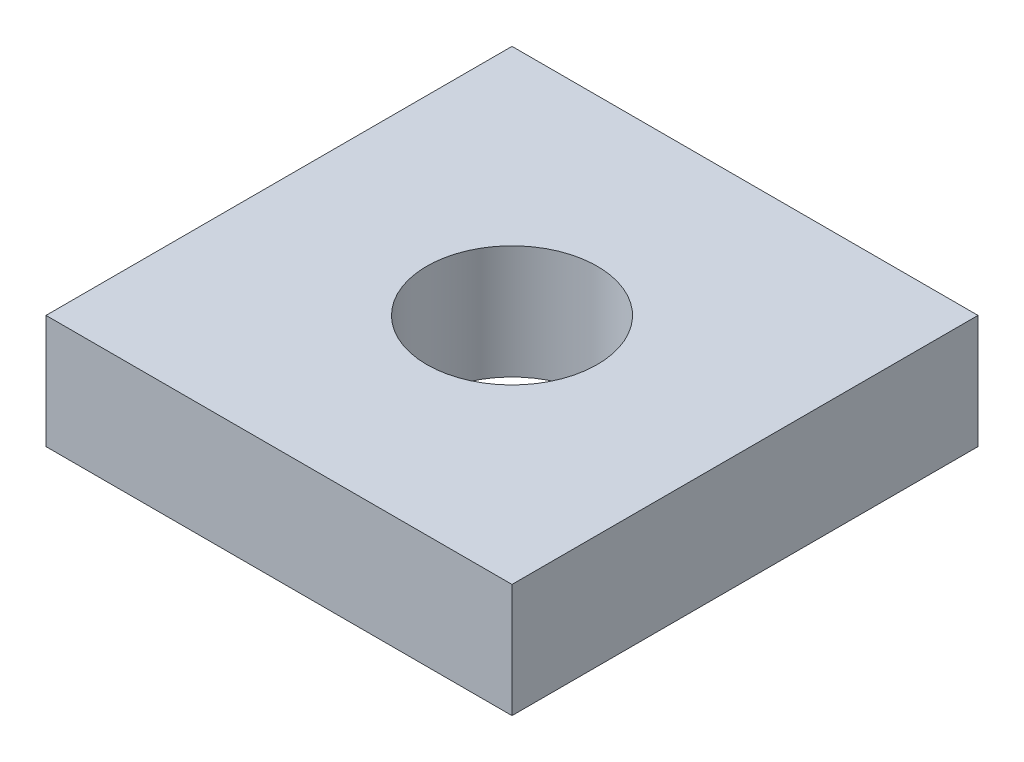
ISO-10303-21;
HEADER;
FILE_DESCRIPTION(('STEP AP214'),'2;1');
FILE_NAME('part.step','',(''),(''),'','','');
FILE_SCHEMA(('AUTOMOTIVE_DESIGN { 1 0 10303 214 1 1 1 1 }'));
ENDSEC;
DATA;
#1=APPLICATION_CONTEXT('core data for automotive mechanical design processes');
#2=APPLICATION_PROTOCOL_DEFINITION('international standard','automotive_design',2000,#1);
#3=PRODUCT_CONTEXT('',#1,'mechanical');
#4=PRODUCT('Part','Part','',(#3));
#5=PRODUCT_RELATED_PRODUCT_CATEGORY('part','',(#4));
#6=PRODUCT_DEFINITION_FORMATION('','',#4);
#7=PRODUCT_DEFINITION_CONTEXT('part definition',#1,'design');
#8=PRODUCT_DEFINITION('design','',#6,#7);
#9=PRODUCT_DEFINITION_SHAPE('','',#8);
#10=(LENGTH_UNIT() NAMED_UNIT(*) SI_UNIT(.MILLI.,.METRE.));
#11=(NAMED_UNIT(*) PLANE_ANGLE_UNIT() SI_UNIT($,.RADIAN.));
#12=(NAMED_UNIT(*) SI_UNIT($,.STERADIAN.) SOLID_ANGLE_UNIT());
#13=UNCERTAINTY_MEASURE_WITH_UNIT(LENGTH_MEASURE(1.E-05),#10,'distance_accuracy_value','');
#14=(GEOMETRIC_REPRESENTATION_CONTEXT(3) GLOBAL_UNCERTAINTY_ASSIGNED_CONTEXT((#13)) GLOBAL_UNIT_ASSIGNED_CONTEXT((#10,
#11,#12)) REPRESENTATION_CONTEXT('',''));
#15=CARTESIAN_POINT('',(0.,0.,0.));
#16=DIRECTION('',(0.,0.,1.));
#17=DIRECTION('',(1.,0.,0.));
#18=AXIS2_PLACEMENT_3D('',#15,#16,#17);
#19=CARTESIAN_POINT('',(0.,2.,0.));
#20=DIRECTION('',(0.,-1.,0.));
#21=DIRECTION('',(0.,0.,-1.));
#22=AXIS2_PLACEMENT_3D('',#19,#20,#21);
#23=PLANE('',#22);
#24=DIRECTION('',(0.,0.,1.));
#25=VECTOR('',#24,1.);
#26=CARTESIAN_POINT('',(0.,2.,0.));
#27=LINE('',#26,#25);
#28=CARTESIAN_POINT('',(0.,2.,-8.2));
#29=VERTEX_POINT('',#28);
#30=CARTESIAN_POINT('',(0.,2.,0.));
#31=VERTEX_POINT('',#30);
#32=EDGE_CURVE('E89',#29,#31,#27,.T.);
#33=ORIENTED_EDGE('',*,*,#32,.T.);
#34=DIRECTION('',(1.,0.,0.));
#35=VECTOR('',#34,1.);
#36=CARTESIAN_POINT('',(0.,2.,0.));
#37=LINE('',#36,#35);
#38=CARTESIAN_POINT('',(8.2,2.,0.));
#39=VERTEX_POINT('',#38);
#40=EDGE_CURVE('E84',#31,#39,#37,.T.);
#41=ORIENTED_EDGE('',*,*,#40,.T.);
#42=DIRECTION('',(0.,0.,-1.));
#43=VECTOR('',#42,1.);
#44=CARTESIAN_POINT('',(8.2,2.,0.));
#45=LINE('',#44,#43);
#46=CARTESIAN_POINT('',(8.2,2.,-8.2));
#47=VERTEX_POINT('',#46);
#48=EDGE_CURVE('E87',#39,#47,#45,.T.);
#49=ORIENTED_EDGE('',*,*,#48,.T.);
#50=DIRECTION('',(-1.,0.,0.));
#51=VECTOR('',#50,1.);
#52=CARTESIAN_POINT('',(0.,2.,-8.2));
#53=LINE('',#52,#51);
#54=EDGE_CURVE('E54',#47,#29,#53,.T.);
#55=ORIENTED_EDGE('',*,*,#54,.T.);
#56=EDGE_LOOP('',(#33,#41,#49,#55));
#57=FACE_BOUND('',#56,.T.);
#58=CARTESIAN_POINT('',(4.1,2.,-4.1));
#59=DIRECTION('',(0.,1.,0.));
#60=DIRECTION('',(0.,0.,1.));
#61=AXIS2_PLACEMENT_3D('',#58,#59,#60);
#62=CIRCLE('',#61,1.5);
#63=CARTESIAN_POINT('',(4.1,2.,-2.6));
#64=VERTEX_POINT('',#63);
#65=EDGE_CURVE('E104',#64,#64,#62,.T.);
#66=ORIENTED_EDGE('',*,*,#65,.F.);
#67=EDGE_LOOP('',(#66));
#68=FACE_BOUND('',#67,.T.);
#69=ADVANCED_FACE('F37',(#57,#68),#23,.F.);
#70=CARTESIAN_POINT('',(0.,0.,0.));
#71=DIRECTION('',(0.,-1.,0.));
#72=DIRECTION('',(0.,0.,-1.));
#73=AXIS2_PLACEMENT_3D('',#70,#71,#72);
#74=PLANE('',#73);
#75=DIRECTION('',(0.,0.,1.));
#76=VECTOR('',#75,1.);
#77=CARTESIAN_POINT('',(0.,0.,0.));
#78=LINE('',#77,#76);
#79=CARTESIAN_POINT('',(0.,0.,-8.2));
#80=VERTEX_POINT('',#79);
#81=CARTESIAN_POINT('',(0.,0.,0.));
#82=VERTEX_POINT('',#81);
#83=EDGE_CURVE('E101',#80,#82,#78,.T.);
#84=ORIENTED_EDGE('',*,*,#83,.F.);
#85=DIRECTION('',(-1.,0.,0.));
#86=VECTOR('',#85,1.);
#87=CARTESIAN_POINT('',(0.,0.,-8.2));
#88=LINE('',#87,#86);
#89=CARTESIAN_POINT('',(8.2,0.,-8.2));
#90=VERTEX_POINT('',#89);
#91=EDGE_CURVE('E77',#90,#80,#88,.T.);
#92=ORIENTED_EDGE('',*,*,#91,.F.);
#93=DIRECTION('',(0.,0.,-1.));
#94=VECTOR('',#93,1.);
#95=CARTESIAN_POINT('',(8.2,0.,0.));
#96=LINE('',#95,#94);
#97=CARTESIAN_POINT('',(8.2,0.,0.));
#98=VERTEX_POINT('',#97);
#99=EDGE_CURVE('E71',#98,#90,#96,.T.);
#100=ORIENTED_EDGE('',*,*,#99,.F.);
#101=DIRECTION('',(1.,0.,0.));
#102=VECTOR('',#101,1.);
#103=CARTESIAN_POINT('',(0.,0.,0.));
#104=LINE('',#103,#102);
#105=EDGE_CURVE('E93',#82,#98,#104,.T.);
#106=ORIENTED_EDGE('',*,*,#105,.F.);
#107=EDGE_LOOP('',(#84,#92,#100,#106));
#108=FACE_BOUND('',#107,.T.);
#109=CARTESIAN_POINT('',(4.1,0.,-4.1));
#110=DIRECTION('',(0.,1.,0.));
#111=DIRECTION('',(0.,0.,1.));
#112=AXIS2_PLACEMENT_3D('',#109,#110,#111);
#113=CIRCLE('',#112,1.5);
#114=CARTESIAN_POINT('',(4.1,0.,-2.6));
#115=VERTEX_POINT('',#114);
#116=EDGE_CURVE('E116',#115,#115,#113,.T.);
#117=ORIENTED_EDGE('',*,*,#116,.T.);
#118=EDGE_LOOP('',(#117));
#119=FACE_BOUND('',#118,.T.);
#120=ADVANCED_FACE('F112',(#108,#119),#74,.T.);
#121=CARTESIAN_POINT('',(0.,2.,0.));
#122=DIRECTION('',(1.,0.,0.));
#123=DIRECTION('',(0.,0.,-1.));
#124=AXIS2_PLACEMENT_3D('',#121,#122,#123);
#125=PLANE('',#124);
#126=ORIENTED_EDGE('',*,*,#83,.T.);
#127=DIRECTION('',(0.,-1.,0.));
#128=VECTOR('',#127,1.);
#129=CARTESIAN_POINT('',(0.,2.,0.));
#130=LINE('',#129,#128);
#131=EDGE_CURVE('E11',#31,#82,#130,.T.);
#132=ORIENTED_EDGE('',*,*,#131,.F.);
#133=ORIENTED_EDGE('',*,*,#32,.F.);
#134=DIRECTION('',(0.,-1.,0.));
#135=VECTOR('',#134,1.);
#136=CARTESIAN_POINT('',(0.,2.,-8.2));
#137=LINE('',#136,#135);
#138=EDGE_CURVE('E97',#29,#80,#137,.T.);
#139=ORIENTED_EDGE('',*,*,#138,.T.);
#140=EDGE_LOOP('',(#126,#132,#133,#139));
#141=FACE_BOUND('',#140,.T.);
#142=ADVANCED_FACE('F39',(#141),#125,.F.);
#143=CARTESIAN_POINT('',(0.,2.,0.));
#144=DIRECTION('',(0.,0.,-1.));
#145=DIRECTION('',(-1.,0.,0.));
#146=AXIS2_PLACEMENT_3D('',#143,#144,#145);
#147=PLANE('',#146);
#148=ORIENTED_EDGE('',*,*,#105,.T.);
#149=DIRECTION('',(0.,-1.,0.));
#150=VECTOR('',#149,1.);
#151=CARTESIAN_POINT('',(8.2,2.,0.));
#152=LINE('',#151,#150);
#153=EDGE_CURVE('E46',#39,#98,#152,.T.);
#154=ORIENTED_EDGE('',*,*,#153,.F.);
#155=ORIENTED_EDGE('',*,*,#40,.F.);
#156=ORIENTED_EDGE('',*,*,#131,.T.);
#157=EDGE_LOOP('',(#148,#154,#155,#156));
#158=FACE_BOUND('',#157,.T.);
#159=ADVANCED_FACE('F92',(#158),#147,.F.);
#160=CARTESIAN_POINT('',(8.2,2.,0.));
#161=DIRECTION('',(-1.,0.,0.));
#162=DIRECTION('',(0.,0.,1.));
#163=AXIS2_PLACEMENT_3D('',#160,#161,#162);
#164=PLANE('',#163);
#165=ORIENTED_EDGE('',*,*,#99,.T.);
#166=DIRECTION('',(0.,-1.,0.));
#167=VECTOR('',#166,1.);
#168=CARTESIAN_POINT('',(8.2,2.,-8.2));
#169=LINE('',#168,#167);
#170=EDGE_CURVE('E94',#47,#90,#169,.T.);
#171=ORIENTED_EDGE('',*,*,#170,.F.);
#172=ORIENTED_EDGE('',*,*,#48,.F.);
#173=ORIENTED_EDGE('',*,*,#153,.T.);
#174=EDGE_LOOP('',(#165,#171,#172,#173));
#175=FACE_BOUND('',#174,.T.);
#176=ADVANCED_FACE('F95',(#175),#164,.F.);
#177=CARTESIAN_POINT('',(0.,2.,-8.2));
#178=DIRECTION('',(0.,0.,1.));
#179=DIRECTION('',(1.,0.,0.));
#180=AXIS2_PLACEMENT_3D('',#177,#178,#179);
#181=PLANE('',#180);
#182=ORIENTED_EDGE('',*,*,#91,.T.);
#183=ORIENTED_EDGE('',*,*,#138,.F.);
#184=ORIENTED_EDGE('',*,*,#54,.F.);
#185=ORIENTED_EDGE('',*,*,#170,.T.);
#186=EDGE_LOOP('',(#182,#183,#184,#185));
#187=FACE_BOUND('',#186,.T.);
#188=ADVANCED_FACE('F109',(#187),#181,.F.);
#189=CARTESIAN_POINT('',(4.1,2.,-4.1));
#190=DIRECTION('',(0.,-1.,0.));
#191=DIRECTION('',(0.,0.,-1.));
#192=AXIS2_PLACEMENT_3D('',#189,#190,#191);
#193=CYLINDRICAL_SURFACE('',#192,1.5);
#194=ORIENTED_EDGE('',*,*,#65,.T.);
#195=EDGE_LOOP('',(#194));
#196=FACE_BOUND('',#195,.T.);
#197=ORIENTED_EDGE('',*,*,#116,.F.);
#198=EDGE_LOOP('',(#197));
#199=FACE_BOUND('',#198,.T.);
#200=ADVANCED_FACE('F122',(#196,#199),#193,.F.);
#201=CLOSED_SHELL('',(#69,#120,#142,#159,#176,#188,#200));
#202=MANIFOLD_SOLID_BREP('B2',#201);
#203=ADVANCED_BREP_SHAPE_REPRESENTATION('',(#18,#202),#14);
#204=SHAPE_DEFINITION_REPRESENTATION(#9,#203);
ENDSEC;
END-ISO-10303-21;
